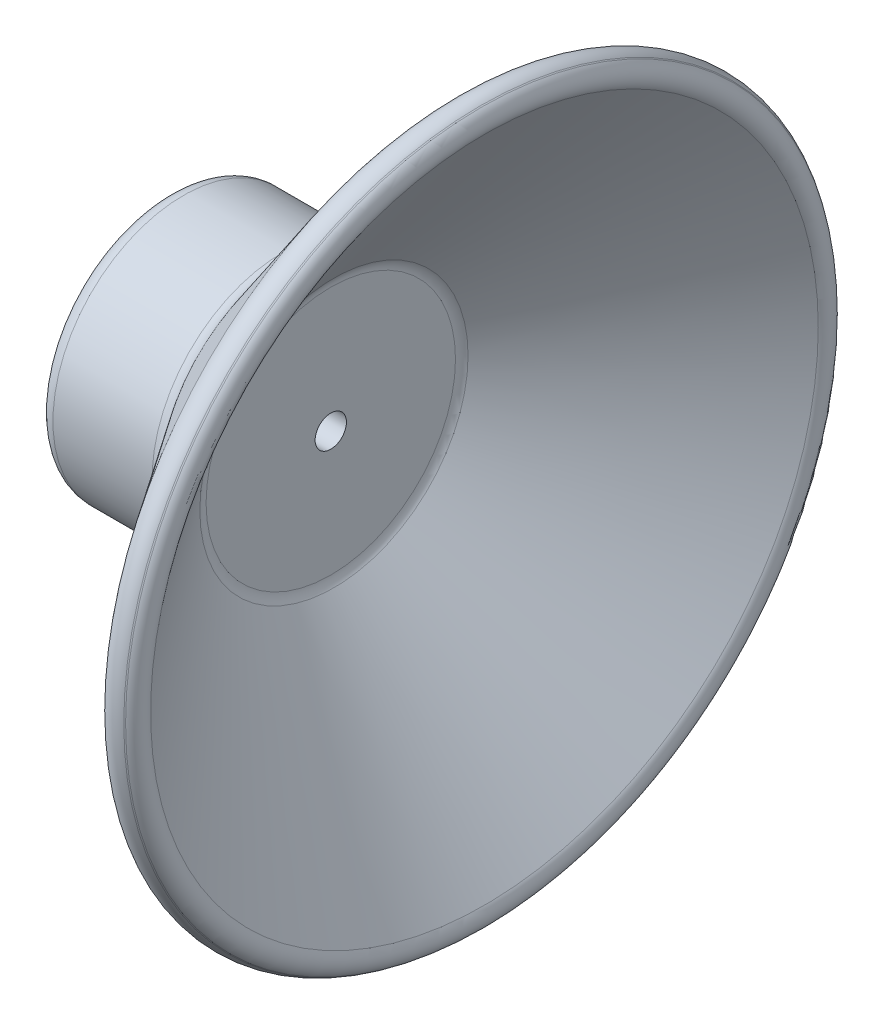
ISO-10303-21;
HEADER;
FILE_DESCRIPTION(('STEP AP214'),'2;1');
FILE_NAME('part.step','',(''),(''),'','','');
FILE_SCHEMA(('AUTOMOTIVE_DESIGN { 1 0 10303 214 1 1 1 1 }'));
ENDSEC;
DATA;
#1=APPLICATION_CONTEXT('core data for automotive mechanical design processes');
#2=APPLICATION_PROTOCOL_DEFINITION('international standard','automotive_design',2000,#1);
#3=PRODUCT_CONTEXT('',#1,'mechanical');
#4=PRODUCT('Part','Part','',(#3));
#5=PRODUCT_RELATED_PRODUCT_CATEGORY('part','',(#4));
#6=PRODUCT_DEFINITION_FORMATION('','',#4);
#7=PRODUCT_DEFINITION_CONTEXT('part definition',#1,'design');
#8=PRODUCT_DEFINITION('design','',#6,#7);
#9=PRODUCT_DEFINITION_SHAPE('','',#8);
#10=(LENGTH_UNIT() NAMED_UNIT(*) SI_UNIT(.MILLI.,.METRE.));
#11=(NAMED_UNIT(*) PLANE_ANGLE_UNIT() SI_UNIT($,.RADIAN.));
#12=(NAMED_UNIT(*) SI_UNIT($,.STERADIAN.) SOLID_ANGLE_UNIT());
#13=UNCERTAINTY_MEASURE_WITH_UNIT(LENGTH_MEASURE(1.E-05),#10,'distance_accuracy_value','');
#14=(GEOMETRIC_REPRESENTATION_CONTEXT(3) GLOBAL_UNCERTAINTY_ASSIGNED_CONTEXT((#13)) GLOBAL_UNIT_ASSIGNED_CONTEXT((#10,
#11,#12)) REPRESENTATION_CONTEXT('',''));
#15=CARTESIAN_POINT('',(0.,0.,0.));
#16=DIRECTION('',(0.,0.,1.));
#17=DIRECTION('',(1.,0.,0.));
#18=AXIS2_PLACEMENT_3D('',#15,#16,#17);
#19=CARTESIAN_POINT('',(-1.46195075853125,0.,-12.1418133267386));
#20=DIRECTION('',(1.,0.,0.));
#21=DIRECTION('',(0.,0.,-1.));
#22=AXIS2_PLACEMENT_3D('',#19,#20,#21);
#23=PLANE('',#22);
#24=CARTESIAN_POINT('',(-1.46195075853125,0.,0.));
#25=DIRECTION('',(1.,0.,0.));
#26=DIRECTION('',(0.,0.,-1.));
#27=AXIS2_PLACEMENT_3D('',#24,#25,#26);
#28=CIRCLE('',#27,1.524);
#29=CARTESIAN_POINT('',(-1.46195075853125,0.,-1.524));
#30=VERTEX_POINT('',#29);
#31=EDGE_CURVE('E104',#30,#30,#28,.T.);
#32=ORIENTED_EDGE('',*,*,#31,.F.);
#33=EDGE_LOOP('',(#32));
#34=FACE_BOUND('',#33,.T.);
#35=CARTESIAN_POINT('',(-1.46195075853125,0.,0.));
#36=DIRECTION('',(1.,0.,0.));
#37=DIRECTION('',(0.,0.,-1.));
#38=AXIS2_PLACEMENT_3D('',#35,#36,#37);
#39=CIRCLE('',#38,12.1418133267386);
#40=CARTESIAN_POINT('',(-1.46195075853125,0.,-12.1418133267386));
#41=VERTEX_POINT('',#40);
#42=EDGE_CURVE('E10',#41,#41,#39,.T.);
#43=ORIENTED_EDGE('',*,*,#42,.T.);
#44=EDGE_LOOP('',(#43));
#45=FACE_BOUND('',#44,.T.);
#46=ADVANCED_FACE('F41',(#34,#45),#23,.T.);
#47=CARTESIAN_POINT('',(0.0620492414687486,0.,0.));
#48=DIRECTION('',(1.,0.,0.));
#49=DIRECTION('',(0.,0.,-1.));
#50=AXIS2_PLACEMENT_3D('',#47,#48,#49);
#51=TOROIDAL_SURFACE('',#50,12.1418133267386,1.524);
#52=CARTESIAN_POINT('',(-1.15507127584333,0.,0.));
#53=DIRECTION('',(1.,0.,0.));
#54=DIRECTION('',(0.,0.,-1.));
#55=AXIS2_PLACEMENT_3D('',#52,#53,#54);
#56=CIRCLE('',#55,13.0589794220223);
#57=CARTESIAN_POINT('',(-1.15507127584333,0.,-13.0589794220223));
#58=VERTEX_POINT('',#57);
#59=EDGE_CURVE('E48',#58,#58,#56,.T.);
#60=ORIENTED_EDGE('',*,*,#59,.T.);
#61=EDGE_LOOP('',(#60));
#62=FACE_BOUND('',#61,.T.);
#63=ORIENTED_EDGE('',*,*,#42,.F.);
#64=EDGE_LOOP('',(#63));
#65=FACE_BOUND('',#64,.T.);
#66=ADVANCED_FACE('F190',(#62,#65),#51,.F.);
#67=CARTESIAN_POINT('',(-1.15507127584333,0.,0.));
#68=DIRECTION('',(1.,0.,0.));
#69=DIRECTION('',(0.,0.,-1.));
#70=AXIS2_PLACEMENT_3D('',#67,#68,#69);
#71=CONICAL_SURFACE('',#70,13.0589794220223,0.925024503556997);
#72=CARTESIAN_POINT('',(13.495883146185,0.,0.));
#73=DIRECTION('',(1.,0.,0.));
#74=DIRECTION('',(0.,0.,-1.));
#75=AXIS2_PLACEMENT_3D('',#72,#73,#74);
#76=CIRCLE('',#75,32.5014526195718);
#77=CARTESIAN_POINT('',(13.495883146185,0.,-32.5014526195718));
#78=VERTEX_POINT('',#77);
#79=EDGE_CURVE('E53',#78,#78,#76,.T.);
#80=ORIENTED_EDGE('',*,*,#79,.T.);
#81=EDGE_LOOP('',(#80));
#82=FACE_BOUND('',#81,.T.);
#83=ORIENTED_EDGE('',*,*,#59,.F.);
#84=EDGE_LOOP('',(#83));
#85=FACE_BOUND('',#84,.T.);
#86=ADVANCED_FACE('F184',(#82,#85),#71,.F.);
#87=CARTESIAN_POINT('',(12.278762628873,0.,0.));
#88=DIRECTION('',(1.,0.,0.));
#89=DIRECTION('',(0.,0.,-1.));
#90=AXIS2_PLACEMENT_3D('',#87,#88,#89);
#91=TOROIDAL_SURFACE('',#90,33.4186187148555,1.524);
#92=CARTESIAN_POINT('',(13.1959287241567,0.,0.));
#93=DIRECTION('',(1.,0.,0.));
#94=DIRECTION('',(0.,0.,-1.));
#95=AXIS2_PLACEMENT_3D('',#92,#93,#94);
#96=CIRCLE('',#95,34.6357392321676);
#97=CARTESIAN_POINT('',(13.1959287241567,0.,-34.6357392321676));
#98=VERTEX_POINT('',#97);
#99=EDGE_CURVE('E58',#98,#98,#96,.T.);
#100=ORIENTED_EDGE('',*,*,#99,.T.);
#101=EDGE_LOOP('',(#100));
#102=FACE_BOUND('',#101,.T.);
#103=ORIENTED_EDGE('',*,*,#79,.F.);
#104=EDGE_LOOP('',(#103));
#105=FACE_BOUND('',#104,.T.);
#106=ADVANCED_FACE('F178',(#102,#105),#91,.T.);
#107=CARTESIAN_POINT('',(13.1959287241567,0.,0.));
#108=DIRECTION('',(-1.,0.,0.));
#109=DIRECTION('',(0.,0.,1.));
#110=AXIS2_PLACEMENT_3D('',#107,#108,#109);
#111=CONICAL_SURFACE('',#110,34.6357392321676,0.645771823237907);
#112=CARTESIAN_POINT('',(13.0945020143807,0.,0.));
#113=DIRECTION('',(1.,0.,0.));
#114=DIRECTION('',(0.,0.,-1.));
#115=AXIS2_PLACEMENT_3D('',#112,#113,#114);
#116=CIRCLE('',#115,34.7121697401079);
#117=CARTESIAN_POINT('',(13.0945020143807,0.,-34.7121697401079));
#118=VERTEX_POINT('',#117);
#119=EDGE_CURVE('E64',#118,#118,#116,.T.);
#120=ORIENTED_EDGE('',*,*,#119,.T.);
#121=EDGE_LOOP('',(#120));
#122=FACE_BOUND('',#121,.T.);
#123=ORIENTED_EDGE('',*,*,#99,.F.);
#124=EDGE_LOOP('',(#123));
#125=FACE_BOUND('',#124,.T.);
#126=ADVANCED_FACE('F172',(#122,#125),#111,.T.);
#127=CARTESIAN_POINT('',(12.1773359190969,0.,0.));
#128=DIRECTION('',(1.,0.,0.));
#129=DIRECTION('',(0.,0.,-1.));
#130=AXIS2_PLACEMENT_3D('',#127,#128,#129);
#131=TOROIDAL_SURFACE('',#130,33.4950492227958,1.524);
#132=CARTESIAN_POINT('',(10.9602154017849,0.,0.));
#133=DIRECTION('',(1.,0.,0.));
#134=DIRECTION('',(0.,0.,-1.));
#135=AXIS2_PLACEMENT_3D('',#132,#133,#134);
#136=CIRCLE('',#135,34.4122153180795);
#137=CARTESIAN_POINT('',(10.9602154017849,0.,-34.4122153180795));
#138=VERTEX_POINT('',#137);
#139=EDGE_CURVE('E68',#138,#138,#136,.T.);
#140=ORIENTED_EDGE('',*,*,#139,.T.);
#141=EDGE_LOOP('',(#140));
#142=FACE_BOUND('',#141,.T.);
#143=ORIENTED_EDGE('',*,*,#119,.F.);
#144=EDGE_LOOP('',(#143));
#145=FACE_BOUND('',#144,.T.);
#146=ADVANCED_FACE('F166',(#142,#145),#131,.T.);
#147=CARTESIAN_POINT('',(10.9602154017849,0.,0.));
#148=DIRECTION('',(1.,0.,0.));
#149=DIRECTION('',(0.,0.,-1.));
#150=AXIS2_PLACEMENT_3D('',#147,#148,#149);
#151=CONICAL_SURFACE('',#150,34.4122153180795,0.925024503556997);
#152=CARTESIAN_POINT('',(-4.94383024121917,0.,0.));
#153=DIRECTION('',(1.,0.,0.));
#154=DIRECTION('',(0.,0.,-1.));
#155=AXIS2_PLACEMENT_3D('',#152,#153,#154);
#156=CIRCLE('',#155,13.3068339047163);
#157=CARTESIAN_POINT('',(-4.94383024121918,0.,-13.3068339047163));
#158=VERTEX_POINT('',#157);
#159=EDGE_CURVE('E72',#158,#158,#156,.T.);
#160=ORIENTED_EDGE('',*,*,#159,.T.);
#161=EDGE_LOOP('',(#160));
#162=FACE_BOUND('',#161,.T.);
#163=ORIENTED_EDGE('',*,*,#139,.F.);
#164=EDGE_LOOP('',(#163));
#165=FACE_BOUND('',#164,.T.);
#166=ADVANCED_FACE('F160',(#162,#165),#151,.T.);
#167=CARTESIAN_POINT('',(-6.16095075853125,0.,0.));
#168=DIRECTION('',(1.,0.,0.));
#169=DIRECTION('',(0.,0.,-1.));
#170=AXIS2_PLACEMENT_3D('',#167,#168,#169);
#171=TOROIDAL_SURFACE('',#170,14.224,1.524);
#172=CARTESIAN_POINT('',(-6.16095075853125,0.,0.));
#173=DIRECTION('',(1.,0.,0.));
#174=DIRECTION('',(0.,0.,-1.));
#175=AXIS2_PLACEMENT_3D('',#172,#173,#174);
#176=CIRCLE('',#175,12.7);
#177=CARTESIAN_POINT('',(-6.16095075853125,0.,-12.7));
#178=VERTEX_POINT('',#177);
#179=EDGE_CURVE('E76',#178,#178,#176,.T.);
#180=ORIENTED_EDGE('',*,*,#179,.T.);
#181=EDGE_LOOP('',(#180));
#182=FACE_BOUND('',#181,.T.);
#183=ORIENTED_EDGE('',*,*,#159,.F.);
#184=EDGE_LOOP('',(#183));
#185=FACE_BOUND('',#184,.T.);
#186=ADVANCED_FACE('F154',(#182,#185),#171,.F.);
#187=CARTESIAN_POINT('',(-1.46195075853125,0.,0.));
#188=DIRECTION('',(1.,0.,0.));
#189=DIRECTION('',(0.,0.,-1.));
#190=AXIS2_PLACEMENT_3D('',#187,#188,#189);
#191=CYLINDRICAL_SURFACE('',#190,12.7);
#192=CARTESIAN_POINT('',(-15.8129507585312,0.,0.));
#193=DIRECTION('',(1.,0.,0.));
#194=DIRECTION('',(0.,0.,-1.));
#195=AXIS2_PLACEMENT_3D('',#192,#193,#194);
#196=CIRCLE('',#195,12.7);
#197=CARTESIAN_POINT('',(-15.8129507585312,0.,-12.7));
#198=VERTEX_POINT('',#197);
#199=EDGE_CURVE('E80',#198,#198,#196,.T.);
#200=ORIENTED_EDGE('',*,*,#199,.T.);
#201=EDGE_LOOP('',(#200));
#202=FACE_BOUND('',#201,.T.);
#203=ORIENTED_EDGE('',*,*,#179,.F.);
#204=EDGE_LOOP('',(#203));
#205=FACE_BOUND('',#204,.T.);
#206=ADVANCED_FACE('F148',(#202,#205),#191,.T.);
#207=CARTESIAN_POINT('',(-15.8129507585313,0.,0.));
#208=DIRECTION('',(1.,0.,0.));
#209=DIRECTION('',(0.,0.,-1.));
#210=AXIS2_PLACEMENT_3D('',#207,#208,#209);
#211=TOROIDAL_SURFACE('',#210,11.176,1.524);
#212=CARTESIAN_POINT('',(-17.3369507585313,0.,0.));
#213=DIRECTION('',(1.,0.,0.));
#214=DIRECTION('',(0.,0.,-1.));
#215=AXIS2_PLACEMENT_3D('',#212,#213,#214);
#216=CIRCLE('',#215,11.176);
#217=CARTESIAN_POINT('',(-17.3369507585313,0.,-11.176));
#218=VERTEX_POINT('',#217);
#219=EDGE_CURVE('E84',#218,#218,#216,.T.);
#220=ORIENTED_EDGE('',*,*,#219,.T.);
#221=EDGE_LOOP('',(#220));
#222=FACE_BOUND('',#221,.T.);
#223=ORIENTED_EDGE('',*,*,#199,.F.);
#224=EDGE_LOOP('',(#223));
#225=FACE_BOUND('',#224,.T.);
#226=ADVANCED_FACE('F142',(#222,#225),#211,.T.);
#227=CARTESIAN_POINT('',(-17.3369507585313,0.,-11.049));
#228=DIRECTION('',(-1.,0.,0.));
#229=DIRECTION('',(0.,0.,1.));
#230=AXIS2_PLACEMENT_3D('',#227,#228,#229);
#231=PLANE('',#230);
#232=CARTESIAN_POINT('',(-17.3369507585313,0.,0.));
#233=DIRECTION('',(1.,0.,0.));
#234=DIRECTION('',(0.,0.,-1.));
#235=AXIS2_PLACEMENT_3D('',#232,#233,#234);
#236=CIRCLE('',#235,11.049);
#237=CARTESIAN_POINT('',(-17.3369507585313,0.,-11.049));
#238=VERTEX_POINT('',#237);
#239=EDGE_CURVE('E88',#238,#238,#236,.T.);
#240=ORIENTED_EDGE('',*,*,#239,.T.);
#241=EDGE_LOOP('',(#240));
#242=FACE_BOUND('',#241,.T.);
#243=ORIENTED_EDGE('',*,*,#219,.F.);
#244=EDGE_LOOP('',(#243));
#245=FACE_BOUND('',#244,.T.);
#246=ADVANCED_FACE('F136',(#242,#245),#231,.T.);
#247=CARTESIAN_POINT('',(-15.8129507585313,0.,0.));
#248=DIRECTION('',(1.,0.,0.));
#249=DIRECTION('',(0.,0.,-1.));
#250=AXIS2_PLACEMENT_3D('',#247,#248,#249);
#251=TOROIDAL_SURFACE('',#250,11.049,1.524);
#252=CARTESIAN_POINT('',(-15.8129507585312,0.,0.));
#253=DIRECTION('',(1.,0.,0.));
#254=DIRECTION('',(0.,0.,-1.));
#255=AXIS2_PLACEMENT_3D('',#252,#253,#254);
#256=CIRCLE('',#255,9.525);
#257=CARTESIAN_POINT('',(-15.8129507585312,0.,-9.525));
#258=VERTEX_POINT('',#257);
#259=EDGE_CURVE('E92',#258,#258,#256,.T.);
#260=ORIENTED_EDGE('',*,*,#259,.T.);
#261=EDGE_LOOP('',(#260));
#262=FACE_BOUND('',#261,.T.);
#263=ORIENTED_EDGE('',*,*,#239,.F.);
#264=EDGE_LOOP('',(#263));
#265=FACE_BOUND('',#264,.T.);
#266=ADVANCED_FACE('F130',(#262,#265),#251,.T.);
#267=CARTESIAN_POINT('',(-1.46195075853125,0.,0.));
#268=DIRECTION('',(1.,0.,0.));
#269=DIRECTION('',(0.,0.,-1.));
#270=AXIS2_PLACEMENT_3D('',#267,#268,#269);
#271=CYLINDRICAL_SURFACE('',#270,9.525);
#272=CARTESIAN_POINT('',(-6.16095075853125,0.,0.));
#273=DIRECTION('',(1.,0.,0.));
#274=DIRECTION('',(0.,0.,-1.));
#275=AXIS2_PLACEMENT_3D('',#272,#273,#274);
#276=CIRCLE('',#275,9.525);
#277=CARTESIAN_POINT('',(-6.16095075853125,0.,-9.525));
#278=VERTEX_POINT('',#277);
#279=EDGE_CURVE('E96',#278,#278,#276,.T.);
#280=ORIENTED_EDGE('',*,*,#279,.T.);
#281=EDGE_LOOP('',(#280));
#282=FACE_BOUND('',#281,.T.);
#283=ORIENTED_EDGE('',*,*,#259,.F.);
#284=EDGE_LOOP('',(#283));
#285=FACE_BOUND('',#284,.T.);
#286=ADVANCED_FACE('F124',(#282,#285),#271,.F.);
#287=CARTESIAN_POINT('',(-6.16095075853125,0.,0.));
#288=DIRECTION('',(1.,0.,0.));
#289=DIRECTION('',(0.,0.,-1.));
#290=AXIS2_PLACEMENT_3D('',#287,#288,#289);
#291=TOROIDAL_SURFACE('',#290,8.001,1.524);
#292=CARTESIAN_POINT('',(-4.63695075853125,0.,0.));
#293=DIRECTION('',(1.,0.,0.));
#294=DIRECTION('',(0.,0.,-1.));
#295=AXIS2_PLACEMENT_3D('',#292,#293,#294);
#296=CIRCLE('',#295,8.001);
#297=CARTESIAN_POINT('',(-4.63695075853125,0.,-8.001));
#298=VERTEX_POINT('',#297);
#299=EDGE_CURVE('E100',#298,#298,#296,.T.);
#300=ORIENTED_EDGE('',*,*,#299,.T.);
#301=EDGE_LOOP('',(#300));
#302=FACE_BOUND('',#301,.T.);
#303=ORIENTED_EDGE('',*,*,#279,.F.);
#304=EDGE_LOOP('',(#303));
#305=FACE_BOUND('',#304,.T.);
#306=ADVANCED_FACE('F118',(#302,#305),#291,.F.);
#307=CARTESIAN_POINT('',(-4.63695075853125,0.,0.));
#308=DIRECTION('',(-1.,0.,0.));
#309=DIRECTION('',(0.,0.,1.));
#310=AXIS2_PLACEMENT_3D('',#307,#308,#309);
#311=PLANE('',#310);
#312=CARTESIAN_POINT('',(-4.63695075853125,0.,0.));
#313=DIRECTION('',(-1.,0.,0.));
#314=DIRECTION('',(0.,0.,1.));
#315=AXIS2_PLACEMENT_3D('',#312,#313,#314);
#316=CIRCLE('',#315,1.524);
#317=CARTESIAN_POINT('',(-4.63695075853125,0.,1.524));
#318=VERTEX_POINT('',#317);
#319=EDGE_CURVE('E108',#318,#318,#316,.T.);
#320=ORIENTED_EDGE('',*,*,#319,.F.);
#321=EDGE_LOOP('',(#320));
#322=FACE_BOUND('',#321,.T.);
#323=ORIENTED_EDGE('',*,*,#299,.F.);
#324=EDGE_LOOP('',(#323));
#325=FACE_BOUND('',#324,.T.);
#326=ADVANCED_FACE('F115',(#322,#325),#311,.T.);
#327=CARTESIAN_POINT('',(13.802762628873,0.,0.));
#328=DIRECTION('',(-1.,0.,0.));
#329=DIRECTION('',(0.,0.,1.));
#330=AXIS2_PLACEMENT_3D('',#327,#328,#329);
#331=CYLINDRICAL_SURFACE('',#330,1.524);
#332=ORIENTED_EDGE('',*,*,#31,.T.);
#333=EDGE_LOOP('',(#332));
#334=FACE_BOUND('',#333,.T.);
#335=ORIENTED_EDGE('',*,*,#319,.T.);
#336=EDGE_LOOP('',(#335));
#337=FACE_BOUND('',#336,.T.);
#338=ADVANCED_FACE('F113',(#334,#337),#331,.F.);
#339=CLOSED_SHELL('',(#46,#66,#86,#106,#126,#146,#166,#186,#206,#226,#246,#266,#286,#306,#326,#338));
#340=MANIFOLD_SOLID_BREP('B2',#339);
#341=ADVANCED_BREP_SHAPE_REPRESENTATION('',(#18,#340),#14);
#342=SHAPE_DEFINITION_REPRESENTATION(#9,#341);
ENDSEC;
END-ISO-10303-21;
